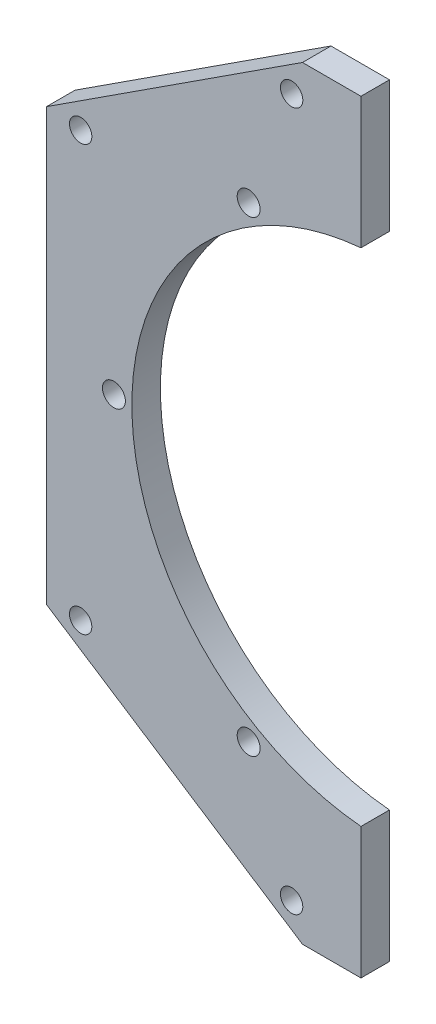
ISO-10303-21;
HEADER;
FILE_DESCRIPTION(('STEP AP214'),'2;1');
FILE_NAME('part.step','',(''),(''),'','','');
FILE_SCHEMA(('AUTOMOTIVE_DESIGN { 1 0 10303 214 1 1 1 1 }'));
ENDSEC;
DATA;
#1=APPLICATION_CONTEXT('core data for automotive mechanical design processes');
#2=APPLICATION_PROTOCOL_DEFINITION('international standard','automotive_design',2000,#1);
#3=PRODUCT_CONTEXT('',#1,'mechanical');
#4=PRODUCT('Part','Part','',(#3));
#5=PRODUCT_RELATED_PRODUCT_CATEGORY('part','',(#4));
#6=PRODUCT_DEFINITION_FORMATION('','',#4);
#7=PRODUCT_DEFINITION_CONTEXT('part definition',#1,'design');
#8=PRODUCT_DEFINITION('design','',#6,#7);
#9=PRODUCT_DEFINITION_SHAPE('','',#8);
#10=(LENGTH_UNIT() NAMED_UNIT(*) SI_UNIT(.MILLI.,.METRE.));
#11=(NAMED_UNIT(*) PLANE_ANGLE_UNIT() SI_UNIT($,.RADIAN.));
#12=(NAMED_UNIT(*) SI_UNIT($,.STERADIAN.) SOLID_ANGLE_UNIT());
#13=UNCERTAINTY_MEASURE_WITH_UNIT(LENGTH_MEASURE(1.E-05),#10,'distance_accuracy_value','');
#14=(GEOMETRIC_REPRESENTATION_CONTEXT(3) GLOBAL_UNCERTAINTY_ASSIGNED_CONTEXT((#13)) GLOBAL_UNIT_ASSIGNED_CONTEXT((#10,
#11,#12)) REPRESENTATION_CONTEXT('',''));
#15=CARTESIAN_POINT('',(0.,0.,0.));
#16=DIRECTION('',(0.,0.,1.));
#17=DIRECTION('',(1.,0.,0.));
#18=AXIS2_PLACEMENT_3D('',#15,#16,#17);
#19=CARTESIAN_POINT('',(0.,0.,0.));
#20=DIRECTION('',(0.,0.,-1.));
#21=DIRECTION('',(-1.,0.,0.));
#22=AXIS2_PLACEMENT_3D('',#19,#20,#21);
#23=PLANE('',#22);
#24=CARTESIAN_POINT('',(-67.4014306676431,-47.2559384397391,0.));
#25=DIRECTION('',(0.,0.,1.));
#26=DIRECTION('',(-1.,0.,0.));
#27=AXIS2_PLACEMENT_3D('',#24,#25,#26);
#28=CIRCLE('',#27,2.48919999999998);
#29=CARTESIAN_POINT('',(-69.8906306676431,-47.2559384397391,0.));
#30=VERTEX_POINT('',#29);
#31=EDGE_CURVE('E279',#30,#30,#28,.T.);
#32=ORIENTED_EDGE('',*,*,#31,.T.);
#33=EDGE_LOOP('',(#32));
#34=FACE_BOUND('',#33,.T.);
#35=CARTESIAN_POINT('',(-20.4358788626994,-77.7557244005807,0.));
#36=DIRECTION('',(0.,0.,1.));
#37=DIRECTION('',(-1.,0.,0.));
#38=AXIS2_PLACEMENT_3D('',#35,#36,#37);
#39=CIRCLE('',#38,2.48919999999998);
#40=CARTESIAN_POINT('',(-22.9250788626994,-77.7557244005807,0.));
#41=VERTEX_POINT('',#40);
#42=EDGE_CURVE('E122',#41,#41,#39,.T.);
#43=ORIENTED_EDGE('',*,*,#42,.T.);
#44=EDGE_LOOP('',(#43));
#45=FACE_BOUND('',#44,.T.);
#46=CARTESIAN_POINT('',(-67.4014306676431,47.2559384397391,0.));
#47=DIRECTION('',(0.,0.,-1.));
#48=DIRECTION('',(-1.,0.,0.));
#49=AXIS2_PLACEMENT_3D('',#46,#47,#48);
#50=CIRCLE('',#49,2.48919999999998);
#51=CARTESIAN_POINT('',(-69.8906306676431,47.2559384397391,0.));
#52=VERTEX_POINT('',#51);
#53=EDGE_CURVE('E162',#52,#52,#50,.T.);
#54=ORIENTED_EDGE('',*,*,#53,.F.);
#55=EDGE_LOOP('',(#54));
#56=FACE_BOUND('',#55,.T.);
#57=CARTESIAN_POINT('',(-20.4358788626994,77.7557244005807,0.));
#58=DIRECTION('',(0.,0.,-1.));
#59=DIRECTION('',(-1.,0.,0.));
#60=AXIS2_PLACEMENT_3D('',#57,#58,#59);
#61=CIRCLE('',#60,2.48919999999998);
#62=CARTESIAN_POINT('',(-22.9250788626994,77.7557244005807,0.));
#63=VERTEX_POINT('',#62);
#64=EDGE_CURVE('E156',#63,#63,#61,.T.);
#65=ORIENTED_EDGE('',*,*,#64,.F.);
#66=EDGE_LOOP('',(#65));
#67=FACE_BOUND('',#66,.T.);
#68=CARTESIAN_POINT('',(0.,0.,0.));
#69=DIRECTION('',(0.,0.,-1.));
#70=DIRECTION('',(-1.,0.,0.));
#71=AXIS2_PLACEMENT_3D('',#68,#69,#70);
#72=CIRCLE('',#71,56.);
#73=CARTESIAN_POINT('',(-5.00000000000001,-55.7763390695374,0.));
#74=VERTEX_POINT('',#73);
#75=CARTESIAN_POINT('',(-5.00000000000001,55.7763390695374,0.));
#76=VERTEX_POINT('',#75);
#77=EDGE_CURVE('E113',#74,#76,#72,.T.);
#78=ORIENTED_EDGE('',*,*,#77,.F.);
#79=DIRECTION('',(0.,-1.,0.));
#80=VECTOR('',#79,1.);
#81=CARTESIAN_POINT('',(-5.00000000000001,-85.,0.));
#82=LINE('',#81,#80);
#83=CARTESIAN_POINT('',(-5.00000000000001,-85.,0.));
#84=VERTEX_POINT('',#83);
#85=EDGE_CURVE('E121',#74,#84,#82,.T.);
#86=ORIENTED_EDGE('',*,*,#85,.T.);
#87=DIRECTION('',(-1.,0.,0.));
#88=VECTOR('',#87,1.);
#89=CARTESIAN_POINT('',(-5.00000000000001,-85.,0.));
#90=LINE('',#89,#88);
#91=CARTESIAN_POINT('',(-18.0249963388607,-85.,0.));
#92=VERTEX_POINT('',#91);
#93=EDGE_CURVE('E135',#84,#92,#90,.T.);
#94=ORIENTED_EDGE('',*,*,#93,.T.);
#95=DIRECTION('',(-0.838670567945423,0.544639035015029,0.));
#96=VECTOR('',#95,1.);
#97=CARTESIAN_POINT('',(-75.,-48.,0.));
#98=LINE('',#97,#96);
#99=CARTESIAN_POINT('',(-75.,-48.,0.));
#100=VERTEX_POINT('',#99);
#101=EDGE_CURVE('E130',#92,#100,#98,.T.);
#102=ORIENTED_EDGE('',*,*,#101,.T.);
#103=DIRECTION('',(0.,-1.,0.));
#104=VECTOR('',#103,1.);
#105=CARTESIAN_POINT('',(-75.,48.,0.));
#106=LINE('',#105,#104);
#107=CARTESIAN_POINT('',(-75.,48.,0.));
#108=VERTEX_POINT('',#107);
#109=EDGE_CURVE('E168',#108,#100,#106,.T.);
#110=ORIENTED_EDGE('',*,*,#109,.F.);
#111=DIRECTION('',(-0.838670567945423,-0.544639035015029,0.));
#112=VECTOR('',#111,1.);
#113=CARTESIAN_POINT('',(-75.,48.,0.));
#114=LINE('',#113,#112);
#115=CARTESIAN_POINT('',(-18.0249963388607,85.,0.));
#116=VERTEX_POINT('',#115);
#117=EDGE_CURVE('E68',#116,#108,#114,.T.);
#118=ORIENTED_EDGE('',*,*,#117,.F.);
#119=DIRECTION('',(-1.,0.,0.));
#120=VECTOR('',#119,1.);
#121=CARTESIAN_POINT('',(-5.00000000000001,85.,0.));
#122=LINE('',#121,#120);
#123=CARTESIAN_POINT('',(-5.00000000000001,85.,0.));
#124=VERTEX_POINT('',#123);
#125=EDGE_CURVE('E63',#124,#116,#122,.T.);
#126=ORIENTED_EDGE('',*,*,#125,.F.);
#127=DIRECTION('',(0.,1.,0.));
#128=VECTOR('',#127,1.);
#129=CARTESIAN_POINT('',(-5.00000000000001,85.,0.));
#130=LINE('',#129,#128);
#131=EDGE_CURVE('E177',#76,#124,#130,.T.);
#132=ORIENTED_EDGE('',*,*,#131,.F.);
#133=EDGE_LOOP('',(#78,#86,#94,#102,#110,#118,#126,#132));
#134=FACE_BOUND('',#133,.T.);
#135=CARTESIAN_POINT('',(-30.0000000000001,51.9615242270663,0.));
#136=DIRECTION('',(0.,0.,1.));
#137=DIRECTION('',(1.,0.,0.));
#138=AXIS2_PLACEMENT_3D('',#135,#136,#137);
#139=CIRCLE('',#138,2.55269999999999);
#140=CARTESIAN_POINT('',(-27.4473000000001,51.9615242270663,0.));
#141=VERTEX_POINT('',#140);
#142=EDGE_CURVE('E123',#141,#141,#139,.T.);
#143=ORIENTED_EDGE('',*,*,#142,.T.);
#144=EDGE_LOOP('',(#143));
#145=FACE_BOUND('',#144,.T.);
#146=CARTESIAN_POINT('',(-60.,-2.28983498828939E-13,0.));
#147=DIRECTION('',(0.,0.,1.));
#148=DIRECTION('',(1.,0.,0.));
#149=AXIS2_PLACEMENT_3D('',#146,#147,#148);
#150=CIRCLE('',#149,2.55269999999999);
#151=CARTESIAN_POINT('',(-57.4473,-2.28983498828939E-13,0.));
#152=VERTEX_POINT('',#151);
#153=EDGE_CURVE('E267',#152,#152,#150,.T.);
#154=ORIENTED_EDGE('',*,*,#153,.T.);
#155=EDGE_LOOP('',(#154));
#156=FACE_BOUND('',#155,.T.);
#157=CARTESIAN_POINT('',(-29.9999999999997,-51.9615242270665,0.));
#158=DIRECTION('',(0.,0.,1.));
#159=DIRECTION('',(1.,0.,0.));
#160=AXIS2_PLACEMENT_3D('',#157,#158,#159);
#161=CIRCLE('',#160,2.55269999999999);
#162=CARTESIAN_POINT('',(-27.4472999999997,-51.9615242270665,0.));
#163=VERTEX_POINT('',#162);
#164=EDGE_CURVE('E257',#163,#163,#161,.T.);
#165=ORIENTED_EDGE('',*,*,#164,.T.);
#166=EDGE_LOOP('',(#165));
#167=FACE_BOUND('',#166,.T.);
#168=ADVANCED_FACE('F32',(#34,#45,#56,#67,#134,#145,#156,#167),#23,.T.);
#169=CARTESIAN_POINT('',(-75.,48.,6.35));
#170=DIRECTION('',(1.,0.,0.));
#171=DIRECTION('',(0.,0.,-1.));
#172=AXIS2_PLACEMENT_3D('',#169,#170,#171);
#173=PLANE('',#172);
#174=ORIENTED_EDGE('',*,*,#109,.T.);
#175=DIRECTION('',(0.,0.,-1.));
#176=VECTOR('',#175,1.);
#177=CARTESIAN_POINT('',(-75.,-48.,6.35));
#178=LINE('',#177,#176);
#179=CARTESIAN_POINT('',(-75.,-48.,6.35));
#180=VERTEX_POINT('',#179);
#181=EDGE_CURVE('E143',#180,#100,#178,.T.);
#182=ORIENTED_EDGE('',*,*,#181,.F.);
#183=DIRECTION('',(0.,-1.,0.));
#184=VECTOR('',#183,1.);
#185=CARTESIAN_POINT('',(-75.,48.,6.35));
#186=LINE('',#185,#184);
#187=CARTESIAN_POINT('',(-75.,48.,6.35));
#188=VERTEX_POINT('',#187);
#189=EDGE_CURVE('E169',#188,#180,#186,.T.);
#190=ORIENTED_EDGE('',*,*,#189,.F.);
#191=DIRECTION('',(0.,0.,-1.));
#192=VECTOR('',#191,1.);
#193=CARTESIAN_POINT('',(-75.,48.,6.35));
#194=LINE('',#193,#192);
#195=EDGE_CURVE('E175',#188,#108,#194,.T.);
#196=ORIENTED_EDGE('',*,*,#195,.T.);
#197=EDGE_LOOP('',(#174,#182,#190,#196));
#198=FACE_BOUND('',#197,.T.);
#199=ADVANCED_FACE('F34',(#198),#173,.F.);
#200=CARTESIAN_POINT('',(-5.00000000000001,85.,6.35));
#201=DIRECTION('',(-1.,0.,0.));
#202=DIRECTION('',(0.,-1.,0.));
#203=AXIS2_PLACEMENT_3D('',#200,#201,#202);
#204=PLANE('',#203);
#205=DIRECTION('',(0.,1.,0.));
#206=VECTOR('',#205,1.);
#207=CARTESIAN_POINT('',(-5.00000000000001,85.,6.35));
#208=LINE('',#207,#206);
#209=CARTESIAN_POINT('',(-5.00000000000001,55.7763390695374,6.35));
#210=VERTEX_POINT('',#209);
#211=CARTESIAN_POINT('',(-5.00000000000001,85.,6.35));
#212=VERTEX_POINT('',#211);
#213=EDGE_CURVE('E73',#210,#212,#208,.T.);
#214=ORIENTED_EDGE('',*,*,#213,.F.);
#215=DIRECTION('',(0.,0.,-1.));
#216=VECTOR('',#215,1.);
#217=CARTESIAN_POINT('',(-5.00000000000001,55.7763390695374,6.35));
#218=LINE('',#217,#216);
#219=EDGE_CURVE('E111',#210,#76,#218,.T.);
#220=ORIENTED_EDGE('',*,*,#219,.T.);
#221=ORIENTED_EDGE('',*,*,#131,.T.);
#222=DIRECTION('',(0.,0.,-1.));
#223=VECTOR('',#222,1.);
#224=CARTESIAN_POINT('',(-5.00000000000001,85.,6.35));
#225=LINE('',#224,#223);
#226=EDGE_CURVE('E11',#212,#124,#225,.T.);
#227=ORIENTED_EDGE('',*,*,#226,.F.);
#228=EDGE_LOOP('',(#214,#220,#221,#227));
#229=FACE_BOUND('',#228,.T.);
#230=ADVANCED_FACE('F196',(#229),#204,.F.);
#231=CARTESIAN_POINT('',(-5.00000000000001,85.,6.35));
#232=DIRECTION('',(0.,-1.,0.));
#233=DIRECTION('',(0.,0.,-1.));
#234=AXIS2_PLACEMENT_3D('',#231,#232,#233);
#235=PLANE('',#234);
#236=ORIENTED_EDGE('',*,*,#125,.T.);
#237=DIRECTION('',(0.,0.,-1.));
#238=VECTOR('',#237,1.);
#239=CARTESIAN_POINT('',(-18.0249963388607,85.,6.35));
#240=LINE('',#239,#238);
#241=CARTESIAN_POINT('',(-18.0249963388607,85.,6.35));
#242=VERTEX_POINT('',#241);
#243=EDGE_CURVE('E41',#242,#116,#240,.T.);
#244=ORIENTED_EDGE('',*,*,#243,.F.);
#245=DIRECTION('',(-1.,0.,0.));
#246=VECTOR('',#245,1.);
#247=CARTESIAN_POINT('',(-5.00000000000001,85.,6.35));
#248=LINE('',#247,#246);
#249=EDGE_CURVE('E172',#212,#242,#248,.T.);
#250=ORIENTED_EDGE('',*,*,#249,.F.);
#251=ORIENTED_EDGE('',*,*,#226,.T.);
#252=EDGE_LOOP('',(#236,#244,#250,#251));
#253=FACE_BOUND('',#252,.T.);
#254=ADVANCED_FACE('F197',(#253),#235,.F.);
#255=CARTESIAN_POINT('',(-75.,48.,6.35));
#256=DIRECTION('',(0.544639035015029,-0.838670567945423,0.));
#257=DIRECTION('',(0.838670567945423,0.544639035015029,0.));
#258=AXIS2_PLACEMENT_3D('',#255,#256,#257);
#259=PLANE('',#258);
#260=ORIENTED_EDGE('',*,*,#117,.T.);
#261=ORIENTED_EDGE('',*,*,#195,.F.);
#262=DIRECTION('',(-0.838670567945423,-0.544639035015029,0.));
#263=VECTOR('',#262,1.);
#264=CARTESIAN_POINT('',(-75.,48.,6.35));
#265=LINE('',#264,#263);
#266=EDGE_CURVE('E49',#242,#188,#265,.T.);
#267=ORIENTED_EDGE('',*,*,#266,.F.);
#268=ORIENTED_EDGE('',*,*,#243,.T.);
#269=EDGE_LOOP('',(#260,#261,#267,#268));
#270=FACE_BOUND('',#269,.T.);
#271=ADVANCED_FACE('F181',(#270),#259,.F.);
#272=CARTESIAN_POINT('',(0.,0.,6.35));
#273=DIRECTION('',(0.,0.,-1.));
#274=DIRECTION('',(-1.,0.,0.));
#275=AXIS2_PLACEMENT_3D('',#272,#273,#274);
#276=PLANE('',#275);
#277=CARTESIAN_POINT('',(-29.9999999999997,-51.9615242270665,6.35));
#278=DIRECTION('',(0.,0.,1.));
#279=DIRECTION('',(1.,0.,0.));
#280=AXIS2_PLACEMENT_3D('',#277,#278,#279);
#281=CIRCLE('',#280,2.55269999999999);
#282=CARTESIAN_POINT('',(-27.4472999999997,-51.9615242270665,6.35));
#283=VERTEX_POINT('',#282);
#284=EDGE_CURVE('E260',#283,#283,#281,.T.);
#285=ORIENTED_EDGE('',*,*,#284,.F.);
#286=EDGE_LOOP('',(#285));
#287=FACE_BOUND('',#286,.T.);
#288=CARTESIAN_POINT('',(-60.,-2.28983498828939E-13,6.35));
#289=DIRECTION('',(0.,0.,1.));
#290=DIRECTION('',(1.,0.,0.));
#291=AXIS2_PLACEMENT_3D('',#288,#289,#290);
#292=CIRCLE('',#291,2.55269999999998);
#293=CARTESIAN_POINT('',(-57.4473,-2.28983498828939E-13,6.35));
#294=VERTEX_POINT('',#293);
#295=EDGE_CURVE('E262',#294,#294,#292,.T.);
#296=ORIENTED_EDGE('',*,*,#295,.F.);
#297=EDGE_LOOP('',(#296));
#298=FACE_BOUND('',#297,.T.);
#299=CARTESIAN_POINT('',(-30.0000000000001,51.9615242270663,6.35));
#300=DIRECTION('',(0.,0.,1.));
#301=DIRECTION('',(1.,0.,0.));
#302=AXIS2_PLACEMENT_3D('',#299,#300,#301);
#303=CIRCLE('',#302,2.55269999999999);
#304=CARTESIAN_POINT('',(-27.4473000000001,51.9615242270663,6.35));
#305=VERTEX_POINT('',#304);
#306=EDGE_CURVE('E270',#305,#305,#303,.T.);
#307=ORIENTED_EDGE('',*,*,#306,.F.);
#308=EDGE_LOOP('',(#307));
#309=FACE_BOUND('',#308,.T.);
#310=CARTESIAN_POINT('',(-20.4358788626994,77.7557244005807,6.35));
#311=DIRECTION('',(0.,0.,-1.));
#312=DIRECTION('',(-1.,0.,0.));
#313=AXIS2_PLACEMENT_3D('',#310,#311,#312);
#314=CIRCLE('',#313,2.48919999999997);
#315=CARTESIAN_POINT('',(-22.9250788626994,77.7557244005807,6.35));
#316=VERTEX_POINT('',#315);
#317=EDGE_CURVE('E159',#316,#316,#314,.T.);
#318=ORIENTED_EDGE('',*,*,#317,.T.);
#319=EDGE_LOOP('',(#318));
#320=FACE_BOUND('',#319,.T.);
#321=CARTESIAN_POINT('',(-67.4014306676431,47.2559384397391,6.35));
#322=DIRECTION('',(0.,0.,-1.));
#323=DIRECTION('',(-1.,0.,0.));
#324=AXIS2_PLACEMENT_3D('',#321,#322,#323);
#325=CIRCLE('',#324,2.48919999999998);
#326=CARTESIAN_POINT('',(-69.8906306676431,47.2559384397391,6.35));
#327=VERTEX_POINT('',#326);
#328=EDGE_CURVE('E165',#327,#327,#325,.T.);
#329=ORIENTED_EDGE('',*,*,#328,.T.);
#330=EDGE_LOOP('',(#329));
#331=FACE_BOUND('',#330,.T.);
#332=ORIENTED_EDGE('',*,*,#189,.T.);
#333=DIRECTION('',(-0.838670567945423,0.544639035015029,0.));
#334=VECTOR('',#333,1.);
#335=CARTESIAN_POINT('',(-75.,-48.,6.35));
#336=LINE('',#335,#334);
#337=CARTESIAN_POINT('',(-18.0249963388607,-85.,6.35));
#338=VERTEX_POINT('',#337);
#339=EDGE_CURVE('E132',#338,#180,#336,.T.);
#340=ORIENTED_EDGE('',*,*,#339,.F.);
#341=DIRECTION('',(-1.,0.,0.));
#342=VECTOR('',#341,1.);
#343=CARTESIAN_POINT('',(-5.00000000000001,-85.,6.35));
#344=LINE('',#343,#342);
#345=CARTESIAN_POINT('',(-5.00000000000001,-85.,6.35));
#346=VERTEX_POINT('',#345);
#347=EDGE_CURVE('E128',#346,#338,#344,.T.);
#348=ORIENTED_EDGE('',*,*,#347,.F.);
#349=DIRECTION('',(0.,-1.,0.));
#350=VECTOR('',#349,1.);
#351=CARTESIAN_POINT('',(-5.00000000000001,-85.,6.35));
#352=LINE('',#351,#350);
#353=CARTESIAN_POINT('',(-5.00000000000001,-55.7763390695374,6.35));
#354=VERTEX_POINT('',#353);
#355=EDGE_CURVE('E119',#354,#346,#352,.T.);
#356=ORIENTED_EDGE('',*,*,#355,.F.);
#357=CARTESIAN_POINT('',(0.,0.,6.35));
#358=DIRECTION('',(0.,0.,-1.));
#359=DIRECTION('',(-1.,0.,0.));
#360=AXIS2_PLACEMENT_3D('',#357,#358,#359);
#361=CIRCLE('',#360,56.);
#362=EDGE_CURVE('E105',#354,#210,#361,.T.);
#363=ORIENTED_EDGE('',*,*,#362,.T.);
#364=ORIENTED_EDGE('',*,*,#213,.T.);
#365=ORIENTED_EDGE('',*,*,#249,.T.);
#366=ORIENTED_EDGE('',*,*,#266,.T.);
#367=EDGE_LOOP('',(#332,#340,#348,#356,#363,#364,#365,#366));
#368=FACE_BOUND('',#367,.T.);
#369=CARTESIAN_POINT('',(-20.4358788626994,-77.7557244005807,6.35));
#370=DIRECTION('',(0.,0.,1.));
#371=DIRECTION('',(-1.,0.,0.));
#372=AXIS2_PLACEMENT_3D('',#369,#370,#371);
#373=CIRCLE('',#372,2.48919999999997);
#374=CARTESIAN_POINT('',(-22.9250788626994,-77.7557244005807,6.35));
#375=VERTEX_POINT('',#374);
#376=EDGE_CURVE('E277',#375,#375,#373,.T.);
#377=ORIENTED_EDGE('',*,*,#376,.F.);
#378=EDGE_LOOP('',(#377));
#379=FACE_BOUND('',#378,.T.);
#380=CARTESIAN_POINT('',(-67.4014306676431,-47.2559384397391,6.35));
#381=DIRECTION('',(0.,0.,1.));
#382=DIRECTION('',(-1.,0.,0.));
#383=AXIS2_PLACEMENT_3D('',#380,#381,#382);
#384=CIRCLE('',#383,2.48919999999998);
#385=CARTESIAN_POINT('',(-69.8906306676431,-47.2559384397391,6.35));
#386=VERTEX_POINT('',#385);
#387=EDGE_CURVE('E138',#386,#386,#384,.T.);
#388=ORIENTED_EDGE('',*,*,#387,.F.);
#389=EDGE_LOOP('',(#388));
#390=FACE_BOUND('',#389,.T.);
#391=ADVANCED_FACE('F125',(#287,#298,#309,#320,#331,#368,#379,#390),#276,.F.);
#392=CARTESIAN_POINT('',(-67.4014306676431,47.2559384397391,0.));
#393=DIRECTION('',(0.,0.,-1.));
#394=DIRECTION('',(-1.,0.,0.));
#395=AXIS2_PLACEMENT_3D('',#392,#393,#394);
#396=CYLINDRICAL_SURFACE('',#395,2.48919999999998);
#397=ORIENTED_EDGE('',*,*,#53,.T.);
#398=EDGE_LOOP('',(#397));
#399=FACE_BOUND('',#398,.T.);
#400=ORIENTED_EDGE('',*,*,#328,.F.);
#401=EDGE_LOOP('',(#400));
#402=FACE_BOUND('',#401,.T.);
#403=ADVANCED_FACE('F216',(#399,#402),#396,.F.);
#404=CARTESIAN_POINT('',(-20.4358788626994,77.7557244005807,0.));
#405=DIRECTION('',(0.,0.,-1.));
#406=DIRECTION('',(-1.,0.,0.));
#407=AXIS2_PLACEMENT_3D('',#404,#405,#406);
#408=CYLINDRICAL_SURFACE('',#407,2.48919999999997);
#409=ORIENTED_EDGE('',*,*,#64,.T.);
#410=EDGE_LOOP('',(#409));
#411=FACE_BOUND('',#410,.T.);
#412=ORIENTED_EDGE('',*,*,#317,.F.);
#413=EDGE_LOOP('',(#412));
#414=FACE_BOUND('',#413,.T.);
#415=ADVANCED_FACE('F220',(#411,#414),#408,.F.);
#416=CARTESIAN_POINT('',(0.,0.,6.35));
#417=DIRECTION('',(0.,0.,-1.));
#418=DIRECTION('',(-1.,0.,0.));
#419=AXIS2_PLACEMENT_3D('',#416,#417,#418);
#420=CYLINDRICAL_SURFACE('',#419,56.);
#421=ORIENTED_EDGE('',*,*,#77,.T.);
#422=ORIENTED_EDGE('',*,*,#219,.F.);
#423=ORIENTED_EDGE('',*,*,#362,.F.);
#424=DIRECTION('',(0.,0.,-1.));
#425=VECTOR('',#424,1.);
#426=CARTESIAN_POINT('',(-5.00000000000001,-55.7763390695374,6.35));
#427=LINE('',#426,#425);
#428=EDGE_CURVE('E108',#354,#74,#427,.T.);
#429=ORIENTED_EDGE('',*,*,#428,.T.);
#430=EDGE_LOOP('',(#421,#422,#423,#429));
#431=FACE_BOUND('',#430,.T.);
#432=ADVANCED_FACE('F107',(#431),#420,.F.);
#433=CARTESIAN_POINT('',(-5.00000000000001,-85.,6.35));
#434=DIRECTION('',(-1.,0.,0.));
#435=DIRECTION('',(0.,1.,0.));
#436=AXIS2_PLACEMENT_3D('',#433,#434,#435);
#437=PLANE('',#436);
#438=ORIENTED_EDGE('',*,*,#355,.T.);
#439=DIRECTION('',(0.,0.,-1.));
#440=VECTOR('',#439,1.);
#441=CARTESIAN_POINT('',(-5.00000000000001,-85.,6.35));
#442=LINE('',#441,#440);
#443=EDGE_CURVE('E152',#346,#84,#442,.T.);
#444=ORIENTED_EDGE('',*,*,#443,.T.);
#445=ORIENTED_EDGE('',*,*,#85,.F.);
#446=ORIENTED_EDGE('',*,*,#428,.F.);
#447=EDGE_LOOP('',(#438,#444,#445,#446));
#448=FACE_BOUND('',#447,.T.);
#449=ADVANCED_FACE('F117',(#448),#437,.F.);
#450=CARTESIAN_POINT('',(-5.00000000000001,-85.,6.35));
#451=DIRECTION('',(0.,1.,0.));
#452=DIRECTION('',(0.,0.,-1.));
#453=AXIS2_PLACEMENT_3D('',#450,#451,#452);
#454=PLANE('',#453);
#455=ORIENTED_EDGE('',*,*,#93,.F.);
#456=ORIENTED_EDGE('',*,*,#443,.F.);
#457=ORIENTED_EDGE('',*,*,#347,.T.);
#458=DIRECTION('',(0.,0.,-1.));
#459=VECTOR('',#458,1.);
#460=CARTESIAN_POINT('',(-18.0249963388607,-85.,6.35));
#461=LINE('',#460,#459);
#462=EDGE_CURVE('E149',#338,#92,#461,.T.);
#463=ORIENTED_EDGE('',*,*,#462,.T.);
#464=EDGE_LOOP('',(#455,#456,#457,#463));
#465=FACE_BOUND('',#464,.T.);
#466=ADVANCED_FACE('F194',(#465),#454,.F.);
#467=CARTESIAN_POINT('',(-75.,-48.,6.35));
#468=DIRECTION('',(0.544639035015029,0.838670567945423,0.));
#469=DIRECTION('',(0.838670567945423,-0.544639035015029,0.));
#470=AXIS2_PLACEMENT_3D('',#467,#468,#469);
#471=PLANE('',#470);
#472=ORIENTED_EDGE('',*,*,#101,.F.);
#473=ORIENTED_EDGE('',*,*,#462,.F.);
#474=ORIENTED_EDGE('',*,*,#339,.T.);
#475=ORIENTED_EDGE('',*,*,#181,.T.);
#476=EDGE_LOOP('',(#472,#473,#474,#475));
#477=FACE_BOUND('',#476,.T.);
#478=ADVANCED_FACE('F192',(#477),#471,.F.);
#479=CARTESIAN_POINT('',(-67.4014306676431,-47.2559384397391,0.));
#480=DIRECTION('',(0.,0.,-1.));
#481=DIRECTION('',(-1.,0.,0.));
#482=AXIS2_PLACEMENT_3D('',#479,#480,#481);
#483=CYLINDRICAL_SURFACE('',#482,2.48919999999998);
#484=ORIENTED_EDGE('',*,*,#31,.F.);
#485=EDGE_LOOP('',(#484));
#486=FACE_BOUND('',#485,.T.);
#487=ORIENTED_EDGE('',*,*,#387,.T.);
#488=EDGE_LOOP('',(#487));
#489=FACE_BOUND('',#488,.T.);
#490=ADVANCED_FACE('F233',(#486,#489),#483,.F.);
#491=CARTESIAN_POINT('',(-20.4358788626994,-77.7557244005807,0.));
#492=DIRECTION('',(0.,0.,-1.));
#493=DIRECTION('',(-1.,0.,0.));
#494=AXIS2_PLACEMENT_3D('',#491,#492,#493);
#495=CYLINDRICAL_SURFACE('',#494,2.48919999999997);
#496=ORIENTED_EDGE('',*,*,#42,.F.);
#497=EDGE_LOOP('',(#496));
#498=FACE_BOUND('',#497,.T.);
#499=ORIENTED_EDGE('',*,*,#376,.T.);
#500=EDGE_LOOP('',(#499));
#501=FACE_BOUND('',#500,.T.);
#502=ADVANCED_FACE('F236',(#498,#501),#495,.F.);
#503=CARTESIAN_POINT('',(-30.0000000000001,51.9615242270663,6.35));
#504=DIRECTION('',(0.,0.,1.));
#505=DIRECTION('',(1.,0.,0.));
#506=AXIS2_PLACEMENT_3D('',#503,#504,#505);
#507=CYLINDRICAL_SURFACE('',#506,2.55269999999999);
#508=ORIENTED_EDGE('',*,*,#142,.F.);
#509=EDGE_LOOP('',(#508));
#510=FACE_BOUND('',#509,.T.);
#511=ORIENTED_EDGE('',*,*,#306,.T.);
#512=EDGE_LOOP('',(#511));
#513=FACE_BOUND('',#512,.T.);
#514=ADVANCED_FACE('F240',(#510,#513),#507,.F.);
#515=CARTESIAN_POINT('',(-60.,-2.28983498828939E-13,6.35));
#516=DIRECTION('',(0.,0.,1.));
#517=DIRECTION('',(1.,0.,0.));
#518=AXIS2_PLACEMENT_3D('',#515,#516,#517);
#519=CYLINDRICAL_SURFACE('',#518,2.55269999999999);
#520=ORIENTED_EDGE('',*,*,#153,.F.);
#521=EDGE_LOOP('',(#520));
#522=FACE_BOUND('',#521,.T.);
#523=ORIENTED_EDGE('',*,*,#295,.T.);
#524=EDGE_LOOP('',(#523));
#525=FACE_BOUND('',#524,.T.);
#526=ADVANCED_FACE('F244',(#522,#525),#519,.F.);
#527=CARTESIAN_POINT('',(-29.9999999999997,-51.9615242270665,6.35));
#528=DIRECTION('',(0.,0.,1.));
#529=DIRECTION('',(1.,0.,0.));
#530=AXIS2_PLACEMENT_3D('',#527,#528,#529);
#531=CYLINDRICAL_SURFACE('',#530,2.55269999999999);
#532=ORIENTED_EDGE('',*,*,#164,.F.);
#533=EDGE_LOOP('',(#532));
#534=FACE_BOUND('',#533,.T.);
#535=ORIENTED_EDGE('',*,*,#284,.T.);
#536=EDGE_LOOP('',(#535));
#537=FACE_BOUND('',#536,.T.);
#538=ADVANCED_FACE('F248',(#534,#537),#531,.F.);
#539=CLOSED_SHELL('',(#168,#199,#230,#254,#271,#391,#403,#415,#432,#449,#466,#478,#490,#502,
#514,#526,#538));
#540=MANIFOLD_SOLID_BREP('B2',#539);
#541=ADVANCED_BREP_SHAPE_REPRESENTATION('',(#18,#540),#14);
#542=SHAPE_DEFINITION_REPRESENTATION(#9,#541);
ENDSEC;
END-ISO-10303-21;
